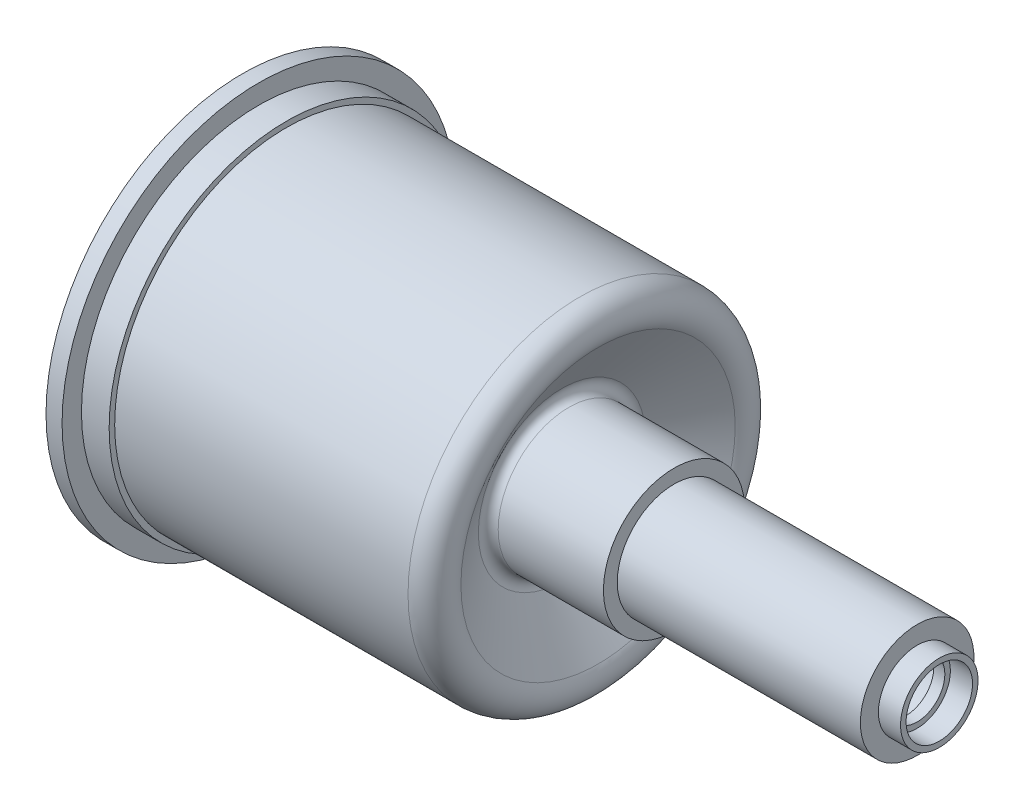
ISO-10303-21;
HEADER;
FILE_DESCRIPTION(('STEP AP214'),'2;1');
FILE_NAME('part.step','',(''),(''),'','','');
FILE_SCHEMA(('AUTOMOTIVE_DESIGN { 1 0 10303 214 1 1 1 1 }'));
ENDSEC;
DATA;
#1=APPLICATION_CONTEXT('core data for automotive mechanical design processes');
#2=APPLICATION_PROTOCOL_DEFINITION('international standard','automotive_design',2000,#1);
#3=PRODUCT_CONTEXT('',#1,'mechanical');
#4=PRODUCT('Part','Part','',(#3));
#5=PRODUCT_RELATED_PRODUCT_CATEGORY('part','',(#4));
#6=PRODUCT_DEFINITION_FORMATION('','',#4);
#7=PRODUCT_DEFINITION_CONTEXT('part definition',#1,'design');
#8=PRODUCT_DEFINITION('design','',#6,#7);
#9=PRODUCT_DEFINITION_SHAPE('','',#8);
#10=(LENGTH_UNIT() NAMED_UNIT(*) SI_UNIT(.MILLI.,.METRE.));
#11=(NAMED_UNIT(*) PLANE_ANGLE_UNIT() SI_UNIT($,.RADIAN.));
#12=(NAMED_UNIT(*) SI_UNIT($,.STERADIAN.) SOLID_ANGLE_UNIT());
#13=UNCERTAINTY_MEASURE_WITH_UNIT(LENGTH_MEASURE(1.E-05),#10,'distance_accuracy_value','');
#14=(GEOMETRIC_REPRESENTATION_CONTEXT(3) GLOBAL_UNCERTAINTY_ASSIGNED_CONTEXT((#13)) GLOBAL_UNIT_ASSIGNED_CONTEXT((#10,
#11,#12)) REPRESENTATION_CONTEXT('',''));
#15=CARTESIAN_POINT('',(0.,0.,0.));
#16=DIRECTION('',(0.,0.,1.));
#17=DIRECTION('',(1.,0.,0.));
#18=AXIS2_PLACEMENT_3D('',#15,#16,#17);
#19=CARTESIAN_POINT('',(-43.9260245489489,0.,0.));
#20=DIRECTION('',(-1.,0.,0.));
#21=DIRECTION('',(0.,0.,1.));
#22=AXIS2_PLACEMENT_3D('',#19,#20,#21);
#23=CYLINDRICAL_SURFACE('',#22,15.748);
#24=CARTESIAN_POINT('',(29.4477734738348,0.,0.));
#25=DIRECTION('',(-1.,0.,0.));
#26=DIRECTION('',(0.,0.,1.));
#27=AXIS2_PLACEMENT_3D('',#24,#25,#26);
#28=CIRCLE('',#27,15.748);
#29=CARTESIAN_POINT('',(29.4477734738348,0.,15.748));
#30=VERTEX_POINT('',#29);
#31=EDGE_CURVE('E104',#30,#30,#28,.T.);
#32=ORIENTED_EDGE('',*,*,#31,.T.);
#33=EDGE_LOOP('',(#32));
#34=FACE_BOUND('',#33,.T.);
#35=CARTESIAN_POINT('',(2.54,0.,0.));
#36=DIRECTION('',(-1.,0.,0.));
#37=DIRECTION('',(0.,0.,1.));
#38=AXIS2_PLACEMENT_3D('',#35,#36,#37);
#39=CIRCLE('',#38,15.748);
#40=CARTESIAN_POINT('',(2.54,0.,15.748));
#41=VERTEX_POINT('',#40);
#42=EDGE_CURVE('E12',#41,#41,#39,.T.);
#43=ORIENTED_EDGE('',*,*,#42,.F.);
#44=EDGE_LOOP('',(#43));
#45=FACE_BOUND('',#44,.T.);
#46=ADVANCED_FACE('F50',(#34,#45),#23,.T.);
#47=CARTESIAN_POINT('',(0.,18.034,0.));
#48=DIRECTION('',(-1.,0.,0.));
#49=DIRECTION('',(0.,0.,1.));
#50=AXIS2_PLACEMENT_3D('',#47,#48,#49);
#51=PLANE('',#50);
#52=CARTESIAN_POINT('',(0.,0.,0.));
#53=DIRECTION('',(-1.,0.,0.));
#54=DIRECTION('',(0.,0.,1.));
#55=AXIS2_PLACEMENT_3D('',#52,#53,#54);
#56=CIRCLE('',#55,18.034);
#57=CARTESIAN_POINT('',(0.,0.,18.034));
#58=VERTEX_POINT('',#57);
#59=EDGE_CURVE('E158',#58,#58,#56,.T.);
#60=ORIENTED_EDGE('',*,*,#59,.F.);
#61=EDGE_LOOP('',(#60));
#62=FACE_BOUND('',#61,.T.);
#63=CARTESIAN_POINT('',(0.,0.,0.));
#64=DIRECTION('',(-1.,0.,0.));
#65=DIRECTION('',(0.,0.,1.));
#66=AXIS2_PLACEMENT_3D('',#63,#64,#65);
#67=CIRCLE('',#66,16.256);
#68=CARTESIAN_POINT('',(0.,0.,16.256));
#69=VERTEX_POINT('',#68);
#70=EDGE_CURVE('E58',#69,#69,#67,.F.);
#71=ORIENTED_EDGE('',*,*,#70,.F.);
#72=EDGE_LOOP('',(#71));
#73=FACE_BOUND('',#72,.T.);
#74=ADVANCED_FACE('F182',(#62,#73),#51,.F.);
#75=CARTESIAN_POINT('',(-43.9260245489489,0.,0.));
#76=DIRECTION('',(-1.,0.,0.));
#77=DIRECTION('',(0.,0.,1.));
#78=AXIS2_PLACEMENT_3D('',#75,#76,#77);
#79=CYLINDRICAL_SURFACE('',#78,2.54);
#80=CARTESIAN_POINT('',(59.3852,0.,0.));
#81=DIRECTION('',(-1.,0.,0.));
#82=DIRECTION('',(0.,0.,1.));
#83=AXIS2_PLACEMENT_3D('',#80,#81,#82);
#84=CIRCLE('',#83,2.54);
#85=CARTESIAN_POINT('',(59.3852,0.,2.54));
#86=VERTEX_POINT('',#85);
#87=EDGE_CURVE('E108',#86,#86,#84,.T.);
#88=ORIENTED_EDGE('',*,*,#87,.T.);
#89=EDGE_LOOP('',(#88));
#90=FACE_BOUND('',#89,.T.);
#91=CARTESIAN_POINT('',(60.4012,0.,0.));
#92=DIRECTION('',(1.,0.,0.));
#93=DIRECTION('',(0.,0.,-1.));
#94=AXIS2_PLACEMENT_3D('',#91,#92,#93);
#95=CIRCLE('',#94,2.54);
#96=CARTESIAN_POINT('',(60.4012,0.,-2.54));
#97=VERTEX_POINT('',#96);
#98=EDGE_CURVE('E71',#97,#97,#95,.T.);
#99=ORIENTED_EDGE('',*,*,#98,.T.);
#100=EDGE_LOOP('',(#99));
#101=FACE_BOUND('',#100,.T.);
#102=ADVANCED_FACE('F188',(#90,#101),#79,.F.);
#103=CARTESIAN_POINT('',(62.4332,3.556,0.));
#104=DIRECTION('',(-1.,0.,0.));
#105=DIRECTION('',(0.,0.,1.));
#106=AXIS2_PLACEMENT_3D('',#103,#104,#105);
#107=PLANE('',#106);
#108=CARTESIAN_POINT('',(62.4332,0.,0.));
#109=DIRECTION('',(1.,0.,0.));
#110=DIRECTION('',(0.,0.,-1.));
#111=AXIS2_PLACEMENT_3D('',#108,#109,#110);
#112=CIRCLE('',#111,3.048);
#113=CARTESIAN_POINT('',(62.4332,0.,-3.048));
#114=VERTEX_POINT('',#113);
#115=EDGE_CURVE('E113',#114,#114,#112,.T.);
#116=ORIENTED_EDGE('',*,*,#115,.F.);
#117=EDGE_LOOP('',(#116));
#118=FACE_BOUND('',#117,.T.);
#119=CARTESIAN_POINT('',(62.4332,0.,0.));
#120=DIRECTION('',(-1.,0.,0.));
#121=DIRECTION('',(0.,0.,1.));
#122=AXIS2_PLACEMENT_3D('',#119,#120,#121);
#123=CIRCLE('',#122,3.556);
#124=CARTESIAN_POINT('',(62.4332,0.,3.556));
#125=VERTEX_POINT('',#124);
#126=EDGE_CURVE('E63',#125,#125,#123,.T.);
#127=ORIENTED_EDGE('',*,*,#126,.F.);
#128=EDGE_LOOP('',(#127));
#129=FACE_BOUND('',#128,.T.);
#130=ADVANCED_FACE('F52',(#118,#129),#107,.F.);
#131=CARTESIAN_POINT('',(-43.9260245489489,0.,0.));
#132=DIRECTION('',(-1.,0.,0.));
#133=DIRECTION('',(0.,0.,1.));
#134=AXIS2_PLACEMENT_3D('',#131,#132,#133);
#135=CYLINDRICAL_SURFACE('',#134,3.556);
#136=CARTESIAN_POINT('',(60.4012,0.,0.));
#137=DIRECTION('',(-1.,0.,0.));
#138=DIRECTION('',(0.,0.,1.));
#139=AXIS2_PLACEMENT_3D('',#136,#137,#138);
#140=CIRCLE('',#139,3.556);
#141=CARTESIAN_POINT('',(60.4012,0.,3.556));
#142=VERTEX_POINT('',#141);
#143=EDGE_CURVE('E68',#142,#142,#140,.T.);
#144=ORIENTED_EDGE('',*,*,#143,.F.);
#145=EDGE_LOOP('',(#144));
#146=FACE_BOUND('',#145,.T.);
#147=ORIENTED_EDGE('',*,*,#126,.T.);
#148=EDGE_LOOP('',(#147));
#149=FACE_BOUND('',#148,.T.);
#150=ADVANCED_FACE('F224',(#146,#149),#135,.T.);
#151=CARTESIAN_POINT('',(60.4012,5.207,0.));
#152=DIRECTION('',(-1.,0.,0.));
#153=DIRECTION('',(0.,0.,1.));
#154=AXIS2_PLACEMENT_3D('',#151,#152,#153);
#155=PLANE('',#154);
#156=CARTESIAN_POINT('',(60.4012,0.,0.));
#157=DIRECTION('',(-1.,0.,0.));
#158=DIRECTION('',(0.,0.,1.));
#159=AXIS2_PLACEMENT_3D('',#156,#157,#158);
#160=CIRCLE('',#159,5.207);
#161=CARTESIAN_POINT('',(60.4012,0.,5.207));
#162=VERTEX_POINT('',#161);
#163=EDGE_CURVE('E80',#162,#162,#160,.T.);
#164=ORIENTED_EDGE('',*,*,#163,.F.);
#165=EDGE_LOOP('',(#164));
#166=FACE_BOUND('',#165,.T.);
#167=ORIENTED_EDGE('',*,*,#143,.T.);
#168=EDGE_LOOP('',(#167));
#169=FACE_BOUND('',#168,.T.);
#170=ADVANCED_FACE('F221',(#166,#169),#155,.F.);
#171=CARTESIAN_POINT('',(-43.9260245489489,0.,0.));
#172=DIRECTION('',(-1.,0.,0.));
#173=DIRECTION('',(0.,0.,1.));
#174=AXIS2_PLACEMENT_3D('',#171,#172,#173);
#175=CYLINDRICAL_SURFACE('',#174,5.207);
#176=CARTESIAN_POINT('',(38.1,0.,0.));
#177=DIRECTION('',(-1.,0.,0.));
#178=DIRECTION('',(0.,0.,1.));
#179=AXIS2_PLACEMENT_3D('',#176,#177,#178);
#180=CIRCLE('',#179,5.207);
#181=CARTESIAN_POINT('',(38.1,0.,5.207));
#182=VERTEX_POINT('',#181);
#183=EDGE_CURVE('E84',#182,#182,#180,.T.);
#184=ORIENTED_EDGE('',*,*,#183,.F.);
#185=EDGE_LOOP('',(#184));
#186=FACE_BOUND('',#185,.T.);
#187=ORIENTED_EDGE('',*,*,#163,.T.);
#188=EDGE_LOOP('',(#187));
#189=FACE_BOUND('',#188,.T.);
#190=ADVANCED_FACE('F217',(#186,#189),#175,.T.);
#191=CARTESIAN_POINT('',(38.1,6.477,0.));
#192=DIRECTION('',(-1.,0.,0.));
#193=DIRECTION('',(0.,0.,1.));
#194=AXIS2_PLACEMENT_3D('',#191,#192,#193);
#195=PLANE('',#194);
#196=CARTESIAN_POINT('',(38.1,0.,0.));
#197=DIRECTION('',(-1.,0.,0.));
#198=DIRECTION('',(0.,0.,1.));
#199=AXIS2_PLACEMENT_3D('',#196,#197,#198);
#200=CIRCLE('',#199,6.477);
#201=CARTESIAN_POINT('',(38.1,0.,6.477));
#202=VERTEX_POINT('',#201);
#203=EDGE_CURVE('E88',#202,#202,#200,.T.);
#204=ORIENTED_EDGE('',*,*,#203,.F.);
#205=EDGE_LOOP('',(#204));
#206=FACE_BOUND('',#205,.T.);
#207=ORIENTED_EDGE('',*,*,#183,.T.);
#208=EDGE_LOOP('',(#207));
#209=FACE_BOUND('',#208,.T.);
#210=ADVANCED_FACE('F213',(#206,#209),#195,.F.);
#211=CARTESIAN_POINT('',(-43.9260245489489,0.,0.));
#212=DIRECTION('',(-1.,0.,0.));
#213=DIRECTION('',(0.,0.,1.));
#214=AXIS2_PLACEMENT_3D('',#211,#212,#213);
#215=CYLINDRICAL_SURFACE('',#214,6.477);
#216=CARTESIAN_POINT('',(28.448,0.,0.));
#217=DIRECTION('',(-1.,0.,0.));
#218=DIRECTION('',(0.,0.,1.));
#219=AXIS2_PLACEMENT_3D('',#216,#217,#218);
#220=CIRCLE('',#219,6.477);
#221=CARTESIAN_POINT('',(28.448,0.,6.477));
#222=VERTEX_POINT('',#221);
#223=EDGE_CURVE('E92',#222,#222,#220,.T.);
#224=ORIENTED_EDGE('',*,*,#223,.F.);
#225=EDGE_LOOP('',(#224));
#226=FACE_BOUND('',#225,.T.);
#227=ORIENTED_EDGE('',*,*,#203,.T.);
#228=EDGE_LOOP('',(#227));
#229=FACE_BOUND('',#228,.T.);
#230=ADVANCED_FACE('F209',(#226,#229),#215,.T.);
#231=CARTESIAN_POINT('',(28.448,0.,0.));
#232=DIRECTION('',(-1.,0.,0.));
#233=DIRECTION('',(0.,0.,1.));
#234=AXIS2_PLACEMENT_3D('',#231,#232,#233);
#235=TOROIDAL_SURFACE('',#234,7.23900000000001,0.762000000000005);
#236=CARTESIAN_POINT('',(27.8163421854652,0.,0.));
#237=DIRECTION('',(-1.,0.,0.));
#238=DIRECTION('',(0.,0.,1.));
#239=AXIS2_PLACEMENT_3D('',#236,#237,#238);
#240=CIRCLE('',#239,7.6652069982264);
#241=CARTESIAN_POINT('',(27.8163421854652,0.,7.6652069982264));
#242=VERTEX_POINT('',#241);
#243=EDGE_CURVE('E96',#242,#242,#240,.T.);
#244=ORIENTED_EDGE('',*,*,#243,.F.);
#245=EDGE_LOOP('',(#244));
#246=FACE_BOUND('',#245,.T.);
#247=ORIENTED_EDGE('',*,*,#223,.T.);
#248=EDGE_LOOP('',(#247));
#249=FACE_BOUND('',#248,.T.);
#250=ADVANCED_FACE('F205',(#246,#249),#235,.F.);
#251=CARTESIAN_POINT('',(27.8163421854652,0.,0.));
#252=DIRECTION('',(1.,0.,0.));
#253=DIRECTION('',(0.,0.,-1.));
#254=AXIS2_PLACEMENT_3D('',#251,#252,#253);
#255=CONICAL_SURFACE('',#254,7.6652069982264,0.977222900924661);
#256=CARTESIAN_POINT('',(31.1321943125942,0.,0.));
#257=DIRECTION('',(-1.,0.,0.));
#258=DIRECTION('',(0.,0.,1.));
#259=AXIS2_PLACEMENT_3D('',#256,#257,#258);
#260=CIRCLE('',#259,12.5794480047296);
#261=CARTESIAN_POINT('',(31.1321943125942,0.,12.5794480047296));
#262=VERTEX_POINT('',#261);
#263=EDGE_CURVE('E100',#262,#262,#260,.T.);
#264=ORIENTED_EDGE('',*,*,#263,.F.);
#265=EDGE_LOOP('',(#264));
#266=FACE_BOUND('',#265,.T.);
#267=ORIENTED_EDGE('',*,*,#243,.T.);
#268=EDGE_LOOP('',(#267));
#269=FACE_BOUND('',#268,.T.);
#270=ADVANCED_FACE('F201',(#266,#269),#255,.F.);
#271=CARTESIAN_POINT('',(29.4477734738348,0.,0.));
#272=DIRECTION('',(-1.,0.,0.));
#273=DIRECTION('',(0.,0.,1.));
#274=AXIS2_PLACEMENT_3D('',#271,#272,#273);
#275=TOROIDAL_SURFACE('',#274,13.716,2.032);
#276=ORIENTED_EDGE('',*,*,#31,.F.);
#277=EDGE_LOOP('',(#276));
#278=FACE_BOUND('',#277,.T.);
#279=ORIENTED_EDGE('',*,*,#263,.T.);
#280=EDGE_LOOP('',(#279));
#281=FACE_BOUND('',#280,.T.);
#282=ADVANCED_FACE('F197',(#278,#281),#275,.T.);
#283=CARTESIAN_POINT('',(59.3852,5.207,0.));
#284=DIRECTION('',(-1.,0.,0.));
#285=DIRECTION('',(0.,0.,1.));
#286=AXIS2_PLACEMENT_3D('',#283,#284,#285);
#287=PLANE('',#286);
#288=CARTESIAN_POINT('',(59.3852,0.,0.));
#289=DIRECTION('',(-1.,0.,0.));
#290=DIRECTION('',(0.,0.,1.));
#291=AXIS2_PLACEMENT_3D('',#288,#289,#290);
#292=CIRCLE('',#291,4.191);
#293=CARTESIAN_POINT('',(59.3852,0.,4.191));
#294=VERTEX_POINT('',#293);
#295=EDGE_CURVE('E138',#294,#294,#292,.T.);
#296=ORIENTED_EDGE('',*,*,#295,.T.);
#297=EDGE_LOOP('',(#296));
#298=FACE_BOUND('',#297,.T.);
#299=ORIENTED_EDGE('',*,*,#87,.F.);
#300=EDGE_LOOP('',(#299));
#301=FACE_BOUND('',#300,.T.);
#302=ADVANCED_FACE('F200',(#298,#301),#287,.T.);
#303=CARTESIAN_POINT('',(-43.9260245489489,0.,0.));
#304=DIRECTION('',(-1.,0.,0.));
#305=DIRECTION('',(0.,0.,1.));
#306=AXIS2_PLACEMENT_3D('',#303,#304,#305);
#307=CYLINDRICAL_SURFACE('',#306,4.191);
#308=CARTESIAN_POINT('',(37.084,0.,0.));
#309=DIRECTION('',(-1.,0.,0.));
#310=DIRECTION('',(0.,0.,1.));
#311=AXIS2_PLACEMENT_3D('',#308,#309,#310);
#312=CIRCLE('',#311,4.191);
#313=CARTESIAN_POINT('',(37.084,0.,4.191));
#314=VERTEX_POINT('',#313);
#315=EDGE_CURVE('E134',#314,#314,#312,.T.);
#316=ORIENTED_EDGE('',*,*,#315,.T.);
#317=EDGE_LOOP('',(#316));
#318=FACE_BOUND('',#317,.T.);
#319=ORIENTED_EDGE('',*,*,#295,.F.);
#320=EDGE_LOOP('',(#319));
#321=FACE_BOUND('',#320,.T.);
#322=ADVANCED_FACE('F262',(#318,#321),#307,.F.);
#323=CARTESIAN_POINT('',(37.084,6.477,0.));
#324=DIRECTION('',(-1.,0.,0.));
#325=DIRECTION('',(0.,0.,1.));
#326=AXIS2_PLACEMENT_3D('',#323,#324,#325);
#327=PLANE('',#326);
#328=CARTESIAN_POINT('',(37.084,0.,0.));
#329=DIRECTION('',(-1.,0.,0.));
#330=DIRECTION('',(0.,0.,1.));
#331=AXIS2_PLACEMENT_3D('',#328,#329,#330);
#332=CIRCLE('',#331,5.461);
#333=CARTESIAN_POINT('',(37.084,0.,5.461));
#334=VERTEX_POINT('',#333);
#335=EDGE_CURVE('E130',#334,#334,#332,.T.);
#336=ORIENTED_EDGE('',*,*,#335,.T.);
#337=EDGE_LOOP('',(#336));
#338=FACE_BOUND('',#337,.T.);
#339=ORIENTED_EDGE('',*,*,#315,.F.);
#340=EDGE_LOOP('',(#339));
#341=FACE_BOUND('',#340,.T.);
#342=ADVANCED_FACE('F266',(#338,#341),#327,.T.);
#343=CARTESIAN_POINT('',(-43.9260245489489,0.,0.));
#344=DIRECTION('',(-1.,0.,0.));
#345=DIRECTION('',(0.,0.,1.));
#346=AXIS2_PLACEMENT_3D('',#343,#344,#345);
#347=CYLINDRICAL_SURFACE('',#346,5.461);
#348=CARTESIAN_POINT('',(28.448,0.,0.));
#349=DIRECTION('',(-1.,0.,0.));
#350=DIRECTION('',(0.,0.,1.));
#351=AXIS2_PLACEMENT_3D('',#348,#349,#350);
#352=CIRCLE('',#351,5.461);
#353=CARTESIAN_POINT('',(28.448,0.,5.461));
#354=VERTEX_POINT('',#353);
#355=EDGE_CURVE('E126',#354,#354,#352,.T.);
#356=ORIENTED_EDGE('',*,*,#355,.T.);
#357=EDGE_LOOP('',(#356));
#358=FACE_BOUND('',#357,.T.);
#359=ORIENTED_EDGE('',*,*,#335,.F.);
#360=EDGE_LOOP('',(#359));
#361=FACE_BOUND('',#360,.T.);
#362=ADVANCED_FACE('F270',(#358,#361),#347,.F.);
#363=CARTESIAN_POINT('',(28.448,0.,0.));
#364=DIRECTION('',(-1.,0.,0.));
#365=DIRECTION('',(0.,0.,1.));
#366=AXIS2_PLACEMENT_3D('',#363,#364,#365);
#367=TOROIDAL_SURFACE('',#366,7.23900000000001,1.77800000000001);
#368=CARTESIAN_POINT('',(26.9741317660855,0.,0.));
#369=DIRECTION('',(1.,0.,0.));
#370=DIRECTION('',(0.,0.,-1.));
#371=AXIS2_PLACEMENT_3D('',#368,#369,#370);
#372=CIRCLE('',#371,8.23348299586159);
#373=CARTESIAN_POINT('',(26.9741317660855,0.,-8.23348299586159));
#374=VERTEX_POINT('',#373);
#375=EDGE_CURVE('E122',#374,#374,#372,.F.);
#376=ORIENTED_EDGE('',*,*,#375,.T.);
#377=EDGE_LOOP('',(#376));
#378=FACE_BOUND('',#377,.T.);
#379=ORIENTED_EDGE('',*,*,#355,.F.);
#380=EDGE_LOOP('',(#379));
#381=FACE_BOUND('',#380,.T.);
#382=ADVANCED_FACE('F274',(#378,#381),#367,.T.);
#383=CARTESIAN_POINT('',(26.9741317660855,0.,0.));
#384=DIRECTION('',(1.,0.,0.));
#385=DIRECTION('',(0.,0.,-1.));
#386=AXIS2_PLACEMENT_3D('',#383,#384,#385);
#387=CONICAL_SURFACE('',#386,8.23348299586159,0.977222900924661);
#388=CARTESIAN_POINT('',(30.2899838932145,0.,0.));
#389=DIRECTION('',(-1.,0.,0.));
#390=DIRECTION('',(0.,0.,1.));
#391=AXIS2_PLACEMENT_3D('',#388,#389,#390);
#392=CIRCLE('',#391,13.1477240023648);
#393=CARTESIAN_POINT('',(30.2899838932145,0.,13.1477240023648));
#394=VERTEX_POINT('',#393);
#395=EDGE_CURVE('E118',#394,#394,#392,.T.);
#396=ORIENTED_EDGE('',*,*,#395,.T.);
#397=EDGE_LOOP('',(#396));
#398=FACE_BOUND('',#397,.T.);
#399=ORIENTED_EDGE('',*,*,#375,.F.);
#400=EDGE_LOOP('',(#399));
#401=FACE_BOUND('',#400,.T.);
#402=ADVANCED_FACE('F278',(#398,#401),#387,.T.);
#403=CARTESIAN_POINT('',(29.4477734738348,0.,0.));
#404=DIRECTION('',(-1.,0.,0.));
#405=DIRECTION('',(0.,0.,1.));
#406=AXIS2_PLACEMENT_3D('',#403,#404,#405);
#407=TOROIDAL_SURFACE('',#406,13.716,1.016);
#408=CARTESIAN_POINT('',(29.4477734738348,0.,0.));
#409=DIRECTION('',(-1.,0.,0.));
#410=DIRECTION('',(0.,0.,1.));
#411=AXIS2_PLACEMENT_3D('',#408,#409,#410);
#412=CIRCLE('',#411,14.732);
#413=CARTESIAN_POINT('',(29.4477734738348,0.,14.732));
#414=VERTEX_POINT('',#413);
#415=EDGE_CURVE('E74',#414,#414,#412,.T.);
#416=ORIENTED_EDGE('',*,*,#415,.T.);
#417=EDGE_LOOP('',(#416));
#418=FACE_BOUND('',#417,.T.);
#419=ORIENTED_EDGE('',*,*,#395,.F.);
#420=EDGE_LOOP('',(#419));
#421=FACE_BOUND('',#420,.T.);
#422=ADVANCED_FACE('F255',(#418,#421),#407,.F.);
#423=CARTESIAN_POINT('',(-43.9260245489489,0.,0.));
#424=DIRECTION('',(-1.,0.,0.));
#425=DIRECTION('',(0.,0.,1.));
#426=AXIS2_PLACEMENT_3D('',#423,#424,#425);
#427=CYLINDRICAL_SURFACE('',#426,14.732);
#428=CARTESIAN_POINT('',(0.,0.,0.));
#429=DIRECTION('',(1.,0.,0.));
#430=DIRECTION('',(0.,0.,-1.));
#431=AXIS2_PLACEMENT_3D('',#428,#429,#430);
#432=CIRCLE('',#431,14.732);
#433=CARTESIAN_POINT('',(0.,0.,-14.732));
#434=VERTEX_POINT('',#433);
#435=EDGE_CURVE('E109',#434,#434,#432,.F.);
#436=ORIENTED_EDGE('',*,*,#435,.T.);
#437=EDGE_LOOP('',(#436));
#438=FACE_BOUND('',#437,.T.);
#439=ORIENTED_EDGE('',*,*,#415,.F.);
#440=EDGE_LOOP('',(#439));
#441=FACE_BOUND('',#440,.T.);
#442=ADVANCED_FACE('F195',(#438,#441),#427,.F.);
#443=CARTESIAN_POINT('',(60.4012,0.,0.));
#444=DIRECTION('',(1.,0.,0.));
#445=DIRECTION('',(0.,0.,-1.));
#446=AXIS2_PLACEMENT_3D('',#443,#444,#445);
#447=CYLINDRICAL_SURFACE('',#446,3.048);
#448=CARTESIAN_POINT('',(60.4012,0.,0.));
#449=DIRECTION('',(1.,0.,0.));
#450=DIRECTION('',(0.,0.,-1.));
#451=AXIS2_PLACEMENT_3D('',#448,#449,#450);
#452=CIRCLE('',#451,3.048);
#453=CARTESIAN_POINT('',(60.4012,0.,-3.048));
#454=VERTEX_POINT('',#453);
#455=EDGE_CURVE('E75',#454,#454,#452,.T.);
#456=ORIENTED_EDGE('',*,*,#455,.F.);
#457=EDGE_LOOP('',(#456));
#458=FACE_BOUND('',#457,.T.);
#459=ORIENTED_EDGE('',*,*,#115,.T.);
#460=EDGE_LOOP('',(#459));
#461=FACE_BOUND('',#460,.T.);
#462=ADVANCED_FACE('F244',(#458,#461),#447,.F.);
#463=CARTESIAN_POINT('',(60.4012,0.,0.));
#464=DIRECTION('',(1.,0.,0.));
#465=DIRECTION('',(0.,0.,-1.));
#466=AXIS2_PLACEMENT_3D('',#463,#464,#465);
#467=PLANE('',#466);
#468=ORIENTED_EDGE('',*,*,#98,.F.);
#469=EDGE_LOOP('',(#468));
#470=FACE_BOUND('',#469,.T.);
#471=ORIENTED_EDGE('',*,*,#455,.T.);
#472=EDGE_LOOP('',(#471));
#473=FACE_BOUND('',#472,.T.);
#474=ADVANCED_FACE('F246',(#470,#473),#467,.T.);
#475=CARTESIAN_POINT('',(0.,0.,0.));
#476=DIRECTION('',(-1.,0.,0.));
#477=DIRECTION('',(0.,0.,1.));
#478=AXIS2_PLACEMENT_3D('',#475,#476,#477);
#479=CIRCLE('',#478,14.224);
#480=CARTESIAN_POINT('',(0.,0.,14.224));
#481=VERTEX_POINT('',#480);
#482=EDGE_CURVE('E154',#481,#481,#479,.T.);
#483=ORIENTED_EDGE('',*,*,#482,.T.);
#484=EDGE_LOOP('',(#483));
#485=FACE_BOUND('',#484,.T.);
#486=ORIENTED_EDGE('',*,*,#435,.F.);
#487=EDGE_LOOP('',(#486));
#488=FACE_BOUND('',#487,.T.);
#489=ADVANCED_FACE('F191',(#485,#488),#51,.F.);
#490=CARTESIAN_POINT('',(-1.4732,18.034,0.));
#491=DIRECTION('',(1.,0.,0.));
#492=DIRECTION('',(0.,0.,-1.));
#493=AXIS2_PLACEMENT_3D('',#490,#491,#492);
#494=PLANE('',#493);
#495=CARTESIAN_POINT('',(-1.4732,0.,0.));
#496=DIRECTION('',(-1.,0.,0.));
#497=DIRECTION('',(0.,0.,1.));
#498=AXIS2_PLACEMENT_3D('',#495,#496,#497);
#499=CIRCLE('',#498,14.224);
#500=CARTESIAN_POINT('',(-1.4732,0.,14.224));
#501=VERTEX_POINT('',#500);
#502=EDGE_CURVE('E114',#501,#501,#499,.T.);
#503=ORIENTED_EDGE('',*,*,#502,.F.);
#504=EDGE_LOOP('',(#503));
#505=FACE_BOUND('',#504,.T.);
#506=CARTESIAN_POINT('',(-1.4732,0.,0.));
#507=DIRECTION('',(-1.,0.,0.));
#508=DIRECTION('',(0.,0.,1.));
#509=AXIS2_PLACEMENT_3D('',#506,#507,#508);
#510=CIRCLE('',#509,18.034);
#511=CARTESIAN_POINT('',(-1.4732,0.,18.034));
#512=VERTEX_POINT('',#511);
#513=EDGE_CURVE('E162',#512,#512,#510,.T.);
#514=ORIENTED_EDGE('',*,*,#513,.T.);
#515=EDGE_LOOP('',(#514));
#516=FACE_BOUND('',#515,.T.);
#517=ADVANCED_FACE('F341',(#505,#516),#494,.F.);
#518=CARTESIAN_POINT('',(-13.4705472454277,0.,0.));
#519=DIRECTION('',(-1.,0.,0.));
#520=DIRECTION('',(0.,0.,1.));
#521=AXIS2_PLACEMENT_3D('',#518,#519,#520);
#522=CYLINDRICAL_SURFACE('',#521,14.224);
#523=ORIENTED_EDGE('',*,*,#482,.F.);
#524=EDGE_LOOP('',(#523));
#525=FACE_BOUND('',#524,.T.);
#526=ORIENTED_EDGE('',*,*,#502,.T.);
#527=EDGE_LOOP('',(#526));
#528=FACE_BOUND('',#527,.T.);
#529=ADVANCED_FACE('F350',(#525,#528),#522,.F.);
#530=CARTESIAN_POINT('',(-13.4705472454277,0.,0.));
#531=DIRECTION('',(-1.,0.,0.));
#532=DIRECTION('',(0.,0.,1.));
#533=AXIS2_PLACEMENT_3D('',#530,#531,#532);
#534=CYLINDRICAL_SURFACE('',#533,18.034);
#535=ORIENTED_EDGE('',*,*,#513,.F.);
#536=EDGE_LOOP('',(#535));
#537=FACE_BOUND('',#536,.T.);
#538=ORIENTED_EDGE('',*,*,#59,.T.);
#539=EDGE_LOOP('',(#538));
#540=FACE_BOUND('',#539,.T.);
#541=ADVANCED_FACE('F179',(#537,#540),#534,.T.);
#542=CARTESIAN_POINT('',(-12.0754041371061,0.,0.));
#543=DIRECTION('',(-1.,0.,0.));
#544=DIRECTION('',(0.,0.,1.));
#545=AXIS2_PLACEMENT_3D('',#542,#543,#544);
#546=CYLINDRICAL_SURFACE('',#545,16.256);
#547=ORIENTED_EDGE('',*,*,#70,.T.);
#548=EDGE_LOOP('',(#547));
#549=FACE_BOUND('',#548,.T.);
#550=CARTESIAN_POINT('',(2.54,0.,0.));
#551=DIRECTION('',(-1.,0.,0.));
#552=DIRECTION('',(0.,0.,1.));
#553=AXIS2_PLACEMENT_3D('',#550,#551,#552);
#554=CIRCLE('',#553,16.256);
#555=CARTESIAN_POINT('',(2.54,0.,16.256));
#556=VERTEX_POINT('',#555);
#557=EDGE_CURVE('E166',#556,#556,#554,.T.);
#558=ORIENTED_EDGE('',*,*,#557,.T.);
#559=EDGE_LOOP('',(#558));
#560=FACE_BOUND('',#559,.T.);
#561=ADVANCED_FACE('F171',(#549,#560),#546,.T.);
#562=CARTESIAN_POINT('',(2.54,15.748,0.));
#563=DIRECTION('',(-1.,0.,0.));
#564=DIRECTION('',(0.,0.,1.));
#565=AXIS2_PLACEMENT_3D('',#562,#563,#564);
#566=PLANE('',#565);
#567=ORIENTED_EDGE('',*,*,#557,.F.);
#568=EDGE_LOOP('',(#567));
#569=FACE_BOUND('',#568,.T.);
#570=ORIENTED_EDGE('',*,*,#42,.T.);
#571=EDGE_LOOP('',(#570));
#572=FACE_BOUND('',#571,.T.);
#573=ADVANCED_FACE('F173',(#569,#572),#566,.F.);
#574=CLOSED_SHELL('',(#46,#74,#102,#130,#150,#170,#190,#210,#230,#250,#270,#282,#302,#322,#342,
#362,#382,#402,#422,#442,#462,#474,#489,#517,#529,#541,#561,#573));
#575=MANIFOLD_SOLID_BREP('B2',#574);
#576=ADVANCED_BREP_SHAPE_REPRESENTATION('',(#18,#575),#14);
#577=SHAPE_DEFINITION_REPRESENTATION(#9,#576);
ENDSEC;
END-ISO-10303-21;
